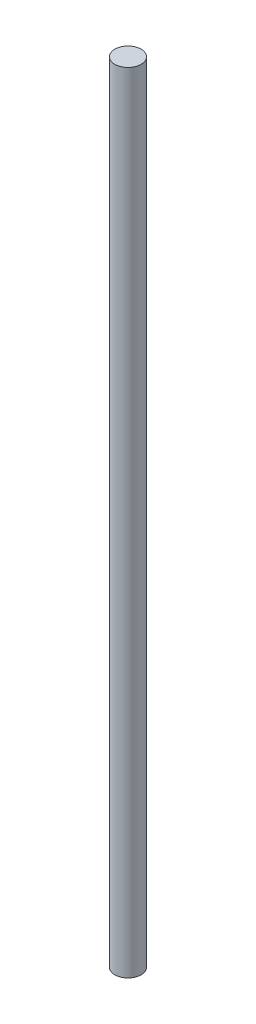
ISO-10303-21;
HEADER;
FILE_DESCRIPTION(('STEP AP214'),'2;1');
FILE_NAME('part.step','',(''),(''),'','','');
FILE_SCHEMA(('AUTOMOTIVE_DESIGN { 1 0 10303 214 1 1 1 1 }'));
ENDSEC;
DATA;
#1=APPLICATION_CONTEXT('core data for automotive mechanical design processes');
#2=APPLICATION_PROTOCOL_DEFINITION('international standard','automotive_design',2000,#1);
#3=PRODUCT_CONTEXT('',#1,'mechanical');
#4=PRODUCT('Part','Part','',(#3));
#5=PRODUCT_RELATED_PRODUCT_CATEGORY('part','',(#4));
#6=PRODUCT_DEFINITION_FORMATION('','',#4);
#7=PRODUCT_DEFINITION_CONTEXT('part definition',#1,'design');
#8=PRODUCT_DEFINITION('design','',#6,#7);
#9=PRODUCT_DEFINITION_SHAPE('','',#8);
#10=(LENGTH_UNIT() NAMED_UNIT(*) SI_UNIT(.MILLI.,.METRE.));
#11=(NAMED_UNIT(*) PLANE_ANGLE_UNIT() SI_UNIT($,.RADIAN.));
#12=(NAMED_UNIT(*) SI_UNIT($,.STERADIAN.) SOLID_ANGLE_UNIT());
#13=UNCERTAINTY_MEASURE_WITH_UNIT(LENGTH_MEASURE(1.E-05),#10,'distance_accuracy_value','');
#14=(GEOMETRIC_REPRESENTATION_CONTEXT(3) GLOBAL_UNCERTAINTY_ASSIGNED_CONTEXT((#13)) GLOBAL_UNIT_ASSIGNED_CONTEXT((#10,
#11,#12)) REPRESENTATION_CONTEXT('',''));
#15=CARTESIAN_POINT('',(0.,0.,0.));
#16=DIRECTION('',(0.,0.,1.));
#17=DIRECTION('',(1.,0.,0.));
#18=AXIS2_PLACEMENT_3D('',#15,#16,#17);
#19=CARTESIAN_POINT('',(0.,7.5,0.));
#20=DIRECTION('',(0.,-1.,0.));
#21=DIRECTION('',(0.,0.,-1.));
#22=AXIS2_PLACEMENT_3D('',#19,#20,#21);
#23=CYLINDRICAL_SURFACE('',#22,0.25);
#24=CARTESIAN_POINT('',(0.,7.5,0.));
#25=DIRECTION('',(0.,1.,0.));
#26=DIRECTION('',(0.,0.,1.));
#27=AXIS2_PLACEMENT_3D('',#24,#25,#26);
#28=CIRCLE('',#27,0.25);
#29=CARTESIAN_POINT('',(0.,7.5,0.25));
#30=VERTEX_POINT('',#29);
#31=EDGE_CURVE('E10',#30,#30,#28,.T.);
#32=ORIENTED_EDGE('',*,*,#31,.F.);
#33=EDGE_LOOP('',(#32));
#34=FACE_BOUND('',#33,.T.);
#35=CARTESIAN_POINT('',(0.,-7.5,0.));
#36=DIRECTION('',(0.,1.,0.));
#37=DIRECTION('',(0.,0.,1.));
#38=AXIS2_PLACEMENT_3D('',#35,#36,#37);
#39=CIRCLE('',#38,0.25);
#40=CARTESIAN_POINT('',(0.,-7.5,0.25));
#41=VERTEX_POINT('',#40);
#42=EDGE_CURVE('E40',#41,#41,#39,.T.);
#43=ORIENTED_EDGE('',*,*,#42,.T.);
#44=EDGE_LOOP('',(#43));
#45=FACE_BOUND('',#44,.T.);
#46=ADVANCED_FACE('F37',(#34,#45),#23,.T.);
#47=CARTESIAN_POINT('',(0.,7.5,0.));
#48=DIRECTION('',(0.,1.,0.));
#49=DIRECTION('',(0.,0.,1.));
#50=AXIS2_PLACEMENT_3D('',#47,#48,#49);
#51=PLANE('',#50);
#52=ORIENTED_EDGE('',*,*,#31,.T.);
#53=EDGE_LOOP('',(#52));
#54=FACE_BOUND('',#53,.T.);
#55=ADVANCED_FACE('F54',(#54),#51,.T.);
#56=CARTESIAN_POINT('',(0.,-7.5,0.));
#57=DIRECTION('',(0.,1.,0.));
#58=DIRECTION('',(0.,0.,1.));
#59=AXIS2_PLACEMENT_3D('',#56,#57,#58);
#60=PLANE('',#59);
#61=ORIENTED_EDGE('',*,*,#42,.F.);
#62=EDGE_LOOP('',(#61));
#63=FACE_BOUND('',#62,.T.);
#64=ADVANCED_FACE('F52',(#63),#60,.F.);
#65=CLOSED_SHELL('',(#46,#55,#64));
#66=MANIFOLD_SOLID_BREP('B2',#65);
#67=ADVANCED_BREP_SHAPE_REPRESENTATION('',(#18,#66),#14);
#68=SHAPE_DEFINITION_REPRESENTATION(#9,#67);
ENDSEC;
END-ISO-10303-21;
